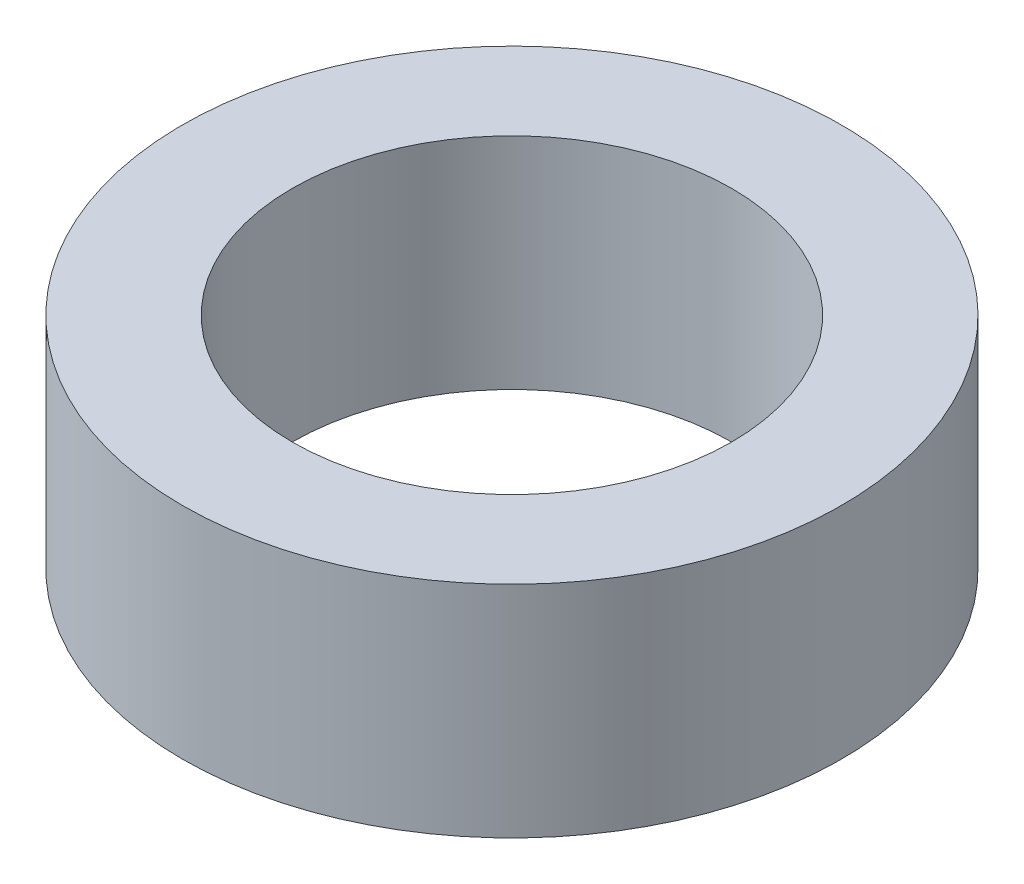
ISO-10303-21;
HEADER;
FILE_DESCRIPTION(('STEP AP214'),'2;1');
FILE_NAME('part.step','',(''),(''),'','','');
FILE_SCHEMA(('AUTOMOTIVE_DESIGN { 1 0 10303 214 1 1 1 1 }'));
ENDSEC;
DATA;
#1=APPLICATION_CONTEXT('core data for automotive mechanical design processes');
#2=APPLICATION_PROTOCOL_DEFINITION('international standard','automotive_design',2000,#1);
#3=PRODUCT_CONTEXT('',#1,'mechanical');
#4=PRODUCT('Part','Part','',(#3));
#5=PRODUCT_RELATED_PRODUCT_CATEGORY('part','',(#4));
#6=PRODUCT_DEFINITION_FORMATION('','',#4);
#7=PRODUCT_DEFINITION_CONTEXT('part definition',#1,'design');
#8=PRODUCT_DEFINITION('design','',#6,#7);
#9=PRODUCT_DEFINITION_SHAPE('','',#8);
#10=(LENGTH_UNIT() NAMED_UNIT(*) SI_UNIT(.MILLI.,.METRE.));
#11=(NAMED_UNIT(*) PLANE_ANGLE_UNIT() SI_UNIT($,.RADIAN.));
#12=(NAMED_UNIT(*) SI_UNIT($,.STERADIAN.) SOLID_ANGLE_UNIT());
#13=UNCERTAINTY_MEASURE_WITH_UNIT(LENGTH_MEASURE(1.E-05),#10,'distance_accuracy_value','');
#14=(GEOMETRIC_REPRESENTATION_CONTEXT(3) GLOBAL_UNCERTAINTY_ASSIGNED_CONTEXT((#13)) GLOBAL_UNIT_ASSIGNED_CONTEXT((#10,
#11,#12)) REPRESENTATION_CONTEXT('',''));
#15=CARTESIAN_POINT('',(0.,0.,0.));
#16=DIRECTION('',(0.,0.,1.));
#17=DIRECTION('',(1.,0.,0.));
#18=AXIS2_PLACEMENT_3D('',#15,#16,#17);
#19=CARTESIAN_POINT('',(0.,3.175,0.));
#20=DIRECTION('',(0.,1.,0.));
#21=DIRECTION('',(0.,0.,1.));
#22=AXIS2_PLACEMENT_3D('',#19,#20,#21);
#23=PLANE('',#22);
#24=CARTESIAN_POINT('',(0.,3.175,0.));
#25=DIRECTION('',(0.,1.,0.));
#26=DIRECTION('',(0.,0.,1.));
#27=AXIS2_PLACEMENT_3D('',#24,#25,#26);
#28=CIRCLE('',#27,4.7625);
#29=CARTESIAN_POINT('',(0.,3.175,4.7625));
#30=VERTEX_POINT('',#29);
#31=EDGE_CURVE('E10',#30,#30,#28,.T.);
#32=ORIENTED_EDGE('',*,*,#31,.T.);
#33=EDGE_LOOP('',(#32));
#34=FACE_BOUND('',#33,.T.);
#35=CARTESIAN_POINT('',(0.,3.175,0.));
#36=DIRECTION('',(0.,1.,0.));
#37=DIRECTION('',(0.,0.,1.));
#38=AXIS2_PLACEMENT_3D('',#35,#36,#37);
#39=CIRCLE('',#38,3.175);
#40=CARTESIAN_POINT('',(0.,3.175,3.175));
#41=VERTEX_POINT('',#40);
#42=EDGE_CURVE('E42',#41,#41,#39,.T.);
#43=ORIENTED_EDGE('',*,*,#42,.F.);
#44=EDGE_LOOP('',(#43));
#45=FACE_BOUND('',#44,.T.);
#46=ADVANCED_FACE('F31',(#34,#45),#23,.T.);
#47=CARTESIAN_POINT('',(0.,0.,0.));
#48=DIRECTION('',(0.,1.,0.));
#49=DIRECTION('',(0.,0.,1.));
#50=AXIS2_PLACEMENT_3D('',#47,#48,#49);
#51=PLANE('',#50);
#52=CARTESIAN_POINT('',(0.,0.,0.));
#53=DIRECTION('',(0.,1.,0.));
#54=DIRECTION('',(0.,0.,1.));
#55=AXIS2_PLACEMENT_3D('',#52,#53,#54);
#56=CIRCLE('',#55,4.7625);
#57=CARTESIAN_POINT('',(0.,0.,4.7625));
#58=VERTEX_POINT('',#57);
#59=EDGE_CURVE('E35',#58,#58,#56,.T.);
#60=ORIENTED_EDGE('',*,*,#59,.F.);
#61=EDGE_LOOP('',(#60));
#62=FACE_BOUND('',#61,.T.);
#63=CARTESIAN_POINT('',(0.,0.,0.));
#64=DIRECTION('',(0.,1.,0.));
#65=DIRECTION('',(0.,0.,1.));
#66=AXIS2_PLACEMENT_3D('',#63,#64,#65);
#67=CIRCLE('',#66,3.175);
#68=CARTESIAN_POINT('',(0.,0.,3.175));
#69=VERTEX_POINT('',#68);
#70=EDGE_CURVE('E44',#69,#69,#67,.T.);
#71=ORIENTED_EDGE('',*,*,#70,.T.);
#72=EDGE_LOOP('',(#71));
#73=FACE_BOUND('',#72,.T.);
#74=ADVANCED_FACE('F54',(#62,#73),#51,.F.);
#75=CARTESIAN_POINT('',(0.,3.175,0.));
#76=DIRECTION('',(0.,-1.,0.));
#77=DIRECTION('',(0.,0.,-1.));
#78=AXIS2_PLACEMENT_3D('',#75,#76,#77);
#79=CYLINDRICAL_SURFACE('',#78,4.7625);
#80=ORIENTED_EDGE('',*,*,#31,.F.);
#81=EDGE_LOOP('',(#80));
#82=FACE_BOUND('',#81,.T.);
#83=ORIENTED_EDGE('',*,*,#59,.T.);
#84=EDGE_LOOP('',(#83));
#85=FACE_BOUND('',#84,.T.);
#86=ADVANCED_FACE('F33',(#82,#85),#79,.T.);
#87=CARTESIAN_POINT('',(0.,3.175,0.));
#88=DIRECTION('',(0.,-1.,0.));
#89=DIRECTION('',(0.,0.,-1.));
#90=AXIS2_PLACEMENT_3D('',#87,#88,#89);
#91=CYLINDRICAL_SURFACE('',#90,3.175);
#92=ORIENTED_EDGE('',*,*,#42,.T.);
#93=EDGE_LOOP('',(#92));
#94=FACE_BOUND('',#93,.T.);
#95=ORIENTED_EDGE('',*,*,#70,.F.);
#96=EDGE_LOOP('',(#95));
#97=FACE_BOUND('',#96,.T.);
#98=ADVANCED_FACE('F50',(#94,#97),#91,.F.);
#99=CLOSED_SHELL('',(#46,#74,#86,#98));
#100=MANIFOLD_SOLID_BREP('B2',#99);
#101=ADVANCED_BREP_SHAPE_REPRESENTATION('',(#18,#100),#14);
#102=SHAPE_DEFINITION_REPRESENTATION(#9,#101);
ENDSEC;
END-ISO-10303-21;
